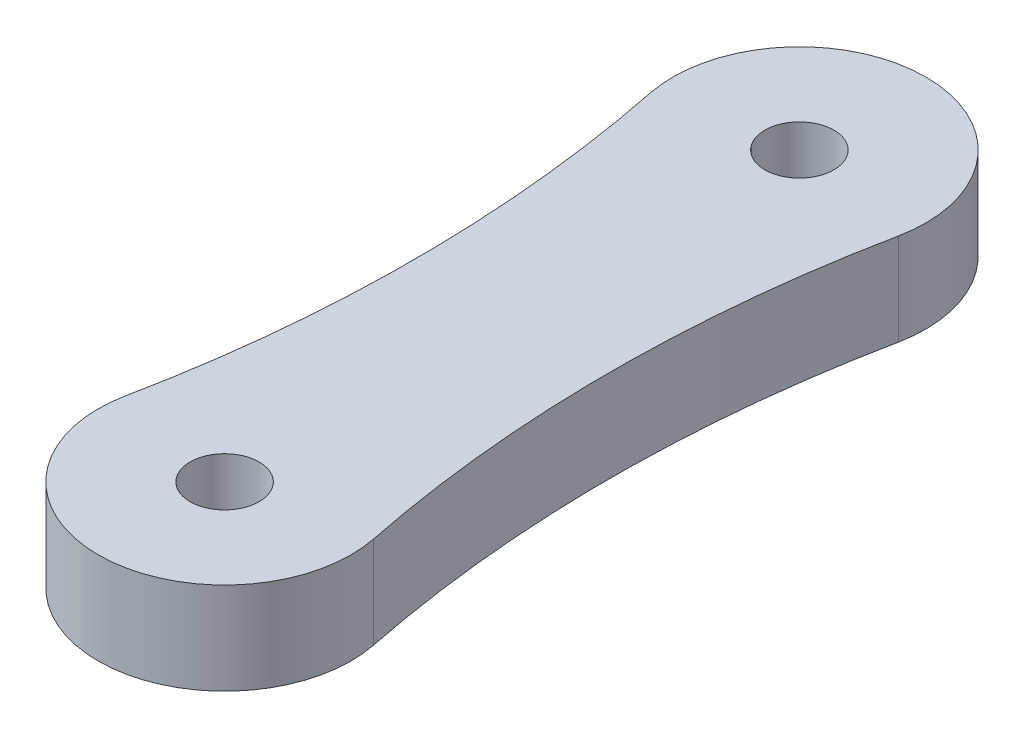
ISO-10303-21;
HEADER;
FILE_DESCRIPTION(('STEP AP214'),'2;1');
FILE_NAME('part.step','',(''),(''),'','','');
FILE_SCHEMA(('AUTOMOTIVE_DESIGN { 1 0 10303 214 1 1 1 1 }'));
ENDSEC;
DATA;
#1=APPLICATION_CONTEXT('core data for automotive mechanical design processes');
#2=APPLICATION_PROTOCOL_DEFINITION('international standard','automotive_design',2000,#1);
#3=PRODUCT_CONTEXT('',#1,'mechanical');
#4=PRODUCT('Part','Part','',(#3));
#5=PRODUCT_RELATED_PRODUCT_CATEGORY('part','',(#4));
#6=PRODUCT_DEFINITION_FORMATION('','',#4);
#7=PRODUCT_DEFINITION_CONTEXT('part definition',#1,'design');
#8=PRODUCT_DEFINITION('design','',#6,#7);
#9=PRODUCT_DEFINITION_SHAPE('','',#8);
#10=(LENGTH_UNIT() NAMED_UNIT(*) SI_UNIT(.MILLI.,.METRE.));
#11=(NAMED_UNIT(*) PLANE_ANGLE_UNIT() SI_UNIT($,.RADIAN.));
#12=(NAMED_UNIT(*) SI_UNIT($,.STERADIAN.) SOLID_ANGLE_UNIT());
#13=UNCERTAINTY_MEASURE_WITH_UNIT(LENGTH_MEASURE(1.E-05),#10,'distance_accuracy_value','');
#14=(GEOMETRIC_REPRESENTATION_CONTEXT(3) GLOBAL_UNCERTAINTY_ASSIGNED_CONTEXT((#13)) GLOBAL_UNIT_ASSIGNED_CONTEXT((#10,
#11,#12)) REPRESENTATION_CONTEXT('',''));
#15=CARTESIAN_POINT('',(0.,0.,0.));
#16=DIRECTION('',(0.,0.,1.));
#17=DIRECTION('',(1.,0.,0.));
#18=AXIS2_PLACEMENT_3D('',#15,#16,#17);
#19=CARTESIAN_POINT('',(-30.9375,4.,-6.24999999999999));
#20=DIRECTION('',(0.,-1.,0.));
#21=DIRECTION('',(0.,0.,-1.));
#22=AXIS2_PLACEMENT_3D('',#19,#20,#21);
#23=PLANE('',#22);
#24=CARTESIAN_POINT('',(-61.875,4.,-12.5));
#25=DIRECTION('',(0.,-1.,0.));
#26=DIRECTION('',(0.,0.,-1.));
#27=AXIS2_PLACEMENT_3D('',#24,#25,#26);
#28=CIRCLE('',#27,57.625);
#29=CARTESIAN_POINT('',(-5.39108910891089,4.,-23.9108910891089));
#30=VERTEX_POINT('',#29);
#31=CARTESIAN_POINT('',(-5.39108910891089,4.,-1.08910891089109));
#32=VERTEX_POINT('',#31);
#33=EDGE_CURVE('E92',#30,#32,#28,.T.);
#34=ORIENTED_EDGE('',*,*,#33,.T.);
#35=CARTESIAN_POINT('',(0.,4.,0.));
#36=DIRECTION('',(0.,1.,0.));
#37=DIRECTION('',(0.,0.,1.));
#38=AXIS2_PLACEMENT_3D('',#35,#36,#37);
#39=CIRCLE('',#38,5.5);
#40=CARTESIAN_POINT('',(5.39108910891088,4.,-1.0891089108911));
#41=VERTEX_POINT('',#40);
#42=EDGE_CURVE('E87',#32,#41,#39,.T.);
#43=ORIENTED_EDGE('',*,*,#42,.T.);
#44=CARTESIAN_POINT('',(61.875,4.,-12.5));
#45=DIRECTION('',(0.,-1.,0.));
#46=DIRECTION('',(0.,0.,1.));
#47=AXIS2_PLACEMENT_3D('',#44,#45,#46);
#48=CIRCLE('',#47,57.625);
#49=CARTESIAN_POINT('',(5.39108910891089,4.,-23.9108910891089));
#50=VERTEX_POINT('',#49);
#51=EDGE_CURVE('E90',#41,#50,#48,.T.);
#52=ORIENTED_EDGE('',*,*,#51,.T.);
#53=CARTESIAN_POINT('',(0.,4.,-25.));
#54=DIRECTION('',(0.,1.,0.));
#55=DIRECTION('',(0.,0.,1.));
#56=AXIS2_PLACEMENT_3D('',#53,#54,#55);
#57=CIRCLE('',#56,5.5);
#58=EDGE_CURVE('E57',#50,#30,#57,.T.);
#59=ORIENTED_EDGE('',*,*,#58,.T.);
#60=EDGE_LOOP('',(#34,#43,#52,#59));
#61=FACE_BOUND('',#60,.T.);
#62=CARTESIAN_POINT('',(0.,4.,0.));
#63=DIRECTION('',(0.,1.,0.));
#64=DIRECTION('',(0.,0.,1.));
#65=AXIS2_PLACEMENT_3D('',#62,#63,#64);
#66=CIRCLE('',#65,1.5);
#67=CARTESIAN_POINT('',(0.,4.,1.5));
#68=VERTEX_POINT('',#67);
#69=EDGE_CURVE('E112',#68,#68,#66,.T.);
#70=ORIENTED_EDGE('',*,*,#69,.F.);
#71=EDGE_LOOP('',(#70));
#72=FACE_BOUND('',#71,.T.);
#73=CARTESIAN_POINT('',(0.,4.,-25.));
#74=DIRECTION('',(0.,1.,0.));
#75=DIRECTION('',(0.,0.,1.));
#76=AXIS2_PLACEMENT_3D('',#73,#74,#75);
#77=CIRCLE('',#76,1.5);
#78=CARTESIAN_POINT('',(0.,4.,-23.5));
#79=VERTEX_POINT('',#78);
#80=EDGE_CURVE('E134',#79,#79,#77,.T.);
#81=ORIENTED_EDGE('',*,*,#80,.F.);
#82=EDGE_LOOP('',(#81));
#83=FACE_BOUND('',#82,.T.);
#84=ADVANCED_FACE('F39',(#61,#72,#83),#23,.F.);
#85=CARTESIAN_POINT('',(-30.9375,0.,-6.24999999999999));
#86=DIRECTION('',(0.,-1.,0.));
#87=DIRECTION('',(0.,0.,-1.));
#88=AXIS2_PLACEMENT_3D('',#85,#86,#87);
#89=PLANE('',#88);
#90=CARTESIAN_POINT('',(0.,0.,0.));
#91=DIRECTION('',(0.,1.,0.));
#92=DIRECTION('',(0.,0.,1.));
#93=AXIS2_PLACEMENT_3D('',#90,#91,#92);
#94=CIRCLE('',#93,1.5);
#95=CARTESIAN_POINT('',(0.,0.,1.5));
#96=VERTEX_POINT('',#95);
#97=EDGE_CURVE('E130',#96,#96,#94,.T.);
#98=ORIENTED_EDGE('',*,*,#97,.T.);
#99=EDGE_LOOP('',(#98));
#100=FACE_BOUND('',#99,.T.);
#101=CARTESIAN_POINT('',(-61.875,0.,-12.5));
#102=DIRECTION('',(0.,-1.,0.));
#103=DIRECTION('',(0.,0.,-1.));
#104=AXIS2_PLACEMENT_3D('',#101,#102,#103);
#105=CIRCLE('',#104,57.625);
#106=CARTESIAN_POINT('',(-5.39108910891089,0.,-23.9108910891089));
#107=VERTEX_POINT('',#106);
#108=CARTESIAN_POINT('',(-5.39108910891089,0.,-1.08910891089109));
#109=VERTEX_POINT('',#108);
#110=EDGE_CURVE('E108',#107,#109,#105,.T.);
#111=ORIENTED_EDGE('',*,*,#110,.F.);
#112=CARTESIAN_POINT('',(0.,0.,-25.));
#113=DIRECTION('',(0.,1.,0.));
#114=DIRECTION('',(0.,0.,1.));
#115=AXIS2_PLACEMENT_3D('',#112,#113,#114);
#116=CIRCLE('',#115,5.5);
#117=CARTESIAN_POINT('',(5.39108910891089,0.,-23.9108910891089));
#118=VERTEX_POINT('',#117);
#119=EDGE_CURVE('E80',#118,#107,#116,.T.);
#120=ORIENTED_EDGE('',*,*,#119,.F.);
#121=CARTESIAN_POINT('',(61.875,0.,-12.5));
#122=DIRECTION('',(0.,-1.,0.));
#123=DIRECTION('',(0.,0.,1.));
#124=AXIS2_PLACEMENT_3D('',#121,#122,#123);
#125=CIRCLE('',#124,57.625);
#126=CARTESIAN_POINT('',(5.39108910891088,0.,-1.0891089108911));
#127=VERTEX_POINT('',#126);
#128=EDGE_CURVE('E74',#127,#118,#125,.T.);
#129=ORIENTED_EDGE('',*,*,#128,.F.);
#130=CARTESIAN_POINT('',(0.,0.,0.));
#131=DIRECTION('',(0.,1.,0.));
#132=DIRECTION('',(0.,0.,1.));
#133=AXIS2_PLACEMENT_3D('',#130,#131,#132);
#134=CIRCLE('',#133,5.5);
#135=EDGE_CURVE('E97',#109,#127,#134,.T.);
#136=ORIENTED_EDGE('',*,*,#135,.F.);
#137=EDGE_LOOP('',(#111,#120,#129,#136));
#138=FACE_BOUND('',#137,.T.);
#139=CARTESIAN_POINT('',(0.,0.,-25.));
#140=DIRECTION('',(0.,1.,0.));
#141=DIRECTION('',(0.,0.,1.));
#142=AXIS2_PLACEMENT_3D('',#139,#140,#141);
#143=CIRCLE('',#142,1.5);
#144=CARTESIAN_POINT('',(0.,0.,-23.5));
#145=VERTEX_POINT('',#144);
#146=EDGE_CURVE('E138',#145,#145,#143,.T.);
#147=ORIENTED_EDGE('',*,*,#146,.T.);
#148=EDGE_LOOP('',(#147));
#149=FACE_BOUND('',#148,.T.);
#150=ADVANCED_FACE('F125',(#100,#138,#149),#89,.T.);
#151=CARTESIAN_POINT('',(-61.875,4.,-12.5));
#152=DIRECTION('',(0.,-1.,0.));
#153=DIRECTION('',(0.,0.,-1.));
#154=AXIS2_PLACEMENT_3D('',#151,#152,#153);
#155=CYLINDRICAL_SURFACE('',#154,57.625);
#156=ORIENTED_EDGE('',*,*,#110,.T.);
#157=DIRECTION('',(0.,-1.,0.));
#158=VECTOR('',#157,1.);
#159=CARTESIAN_POINT('',(-5.39108910891089,4.,-1.08910891089109));
#160=LINE('',#159,#158);
#161=EDGE_CURVE('E11',#32,#109,#160,.T.);
#162=ORIENTED_EDGE('',*,*,#161,.F.);
#163=ORIENTED_EDGE('',*,*,#33,.F.);
#164=DIRECTION('',(0.,-1.,0.));
#165=VECTOR('',#164,1.);
#166=CARTESIAN_POINT('',(-5.39108910891089,4.,-23.9108910891089));
#167=LINE('',#166,#165);
#168=EDGE_CURVE('E104',#30,#107,#167,.T.);
#169=ORIENTED_EDGE('',*,*,#168,.T.);
#170=EDGE_LOOP('',(#156,#162,#163,#169));
#171=FACE_BOUND('',#170,.T.);
#172=ADVANCED_FACE('F41',(#171),#155,.F.);
#173=CARTESIAN_POINT('',(0.,4.,0.));
#174=DIRECTION('',(0.,-1.,0.));
#175=DIRECTION('',(0.,0.,-1.));
#176=AXIS2_PLACEMENT_3D('',#173,#174,#175);
#177=CYLINDRICAL_SURFACE('',#176,5.5);
#178=ORIENTED_EDGE('',*,*,#135,.T.);
#179=DIRECTION('',(0.,-1.,0.));
#180=VECTOR('',#179,1.);
#181=CARTESIAN_POINT('',(5.39108910891088,4.,-1.0891089108911));
#182=LINE('',#181,#180);
#183=EDGE_CURVE('E49',#41,#127,#182,.T.);
#184=ORIENTED_EDGE('',*,*,#183,.F.);
#185=ORIENTED_EDGE('',*,*,#42,.F.);
#186=ORIENTED_EDGE('',*,*,#161,.T.);
#187=EDGE_LOOP('',(#178,#184,#185,#186));
#188=FACE_BOUND('',#187,.T.);
#189=ADVANCED_FACE('F96',(#188),#177,.T.);
#190=CARTESIAN_POINT('',(61.875,4.,-12.5));
#191=DIRECTION('',(0.,-1.,0.));
#192=DIRECTION('',(0.,0.,-1.));
#193=AXIS2_PLACEMENT_3D('',#190,#191,#192);
#194=CYLINDRICAL_SURFACE('',#193,57.625);
#195=ORIENTED_EDGE('',*,*,#128,.T.);
#196=DIRECTION('',(0.,-1.,0.));
#197=VECTOR('',#196,1.);
#198=CARTESIAN_POINT('',(5.39108910891089,4.,-23.9108910891089));
#199=LINE('',#198,#197);
#200=EDGE_CURVE('E99',#50,#118,#199,.T.);
#201=ORIENTED_EDGE('',*,*,#200,.F.);
#202=ORIENTED_EDGE('',*,*,#51,.F.);
#203=ORIENTED_EDGE('',*,*,#183,.T.);
#204=EDGE_LOOP('',(#195,#201,#202,#203));
#205=FACE_BOUND('',#204,.T.);
#206=ADVANCED_FACE('F100',(#205),#194,.F.);
#207=CARTESIAN_POINT('',(0.,4.,-25.));
#208=DIRECTION('',(0.,-1.,0.));
#209=DIRECTION('',(0.,0.,-1.));
#210=AXIS2_PLACEMENT_3D('',#207,#208,#209);
#211=CYLINDRICAL_SURFACE('',#210,5.5);
#212=ORIENTED_EDGE('',*,*,#119,.T.);
#213=ORIENTED_EDGE('',*,*,#168,.F.);
#214=ORIENTED_EDGE('',*,*,#58,.F.);
#215=ORIENTED_EDGE('',*,*,#200,.T.);
#216=EDGE_LOOP('',(#212,#213,#214,#215));
#217=FACE_BOUND('',#216,.T.);
#218=ADVANCED_FACE('F122',(#217),#211,.T.);
#219=CARTESIAN_POINT('',(0.,4.,0.));
#220=DIRECTION('',(0.,-1.,0.));
#221=DIRECTION('',(0.,0.,-1.));
#222=AXIS2_PLACEMENT_3D('',#219,#220,#221);
#223=CYLINDRICAL_SURFACE('',#222,1.5);
#224=ORIENTED_EDGE('',*,*,#69,.T.);
#225=EDGE_LOOP('',(#224));
#226=FACE_BOUND('',#225,.T.);
#227=ORIENTED_EDGE('',*,*,#97,.F.);
#228=EDGE_LOOP('',(#227));
#229=FACE_BOUND('',#228,.T.);
#230=ADVANCED_FACE('F157',(#226,#229),#223,.F.);
#231=CARTESIAN_POINT('',(0.,4.,-25.));
#232=DIRECTION('',(0.,-1.,0.));
#233=DIRECTION('',(0.,0.,-1.));
#234=AXIS2_PLACEMENT_3D('',#231,#232,#233);
#235=CYLINDRICAL_SURFACE('',#234,1.5);
#236=ORIENTED_EDGE('',*,*,#80,.T.);
#237=EDGE_LOOP('',(#236));
#238=FACE_BOUND('',#237,.T.);
#239=ORIENTED_EDGE('',*,*,#146,.F.);
#240=EDGE_LOOP('',(#239));
#241=FACE_BOUND('',#240,.T.);
#242=ADVANCED_FACE('F146',(#238,#241),#235,.F.);
#243=CLOSED_SHELL('',(#84,#150,#172,#189,#206,#218,#230,#242));
#244=MANIFOLD_SOLID_BREP('B2',#243);
#245=ADVANCED_BREP_SHAPE_REPRESENTATION('',(#18,#244),#14);
#246=SHAPE_DEFINITION_REPRESENTATION(#9,#245);
ENDSEC;
END-ISO-10303-21;
